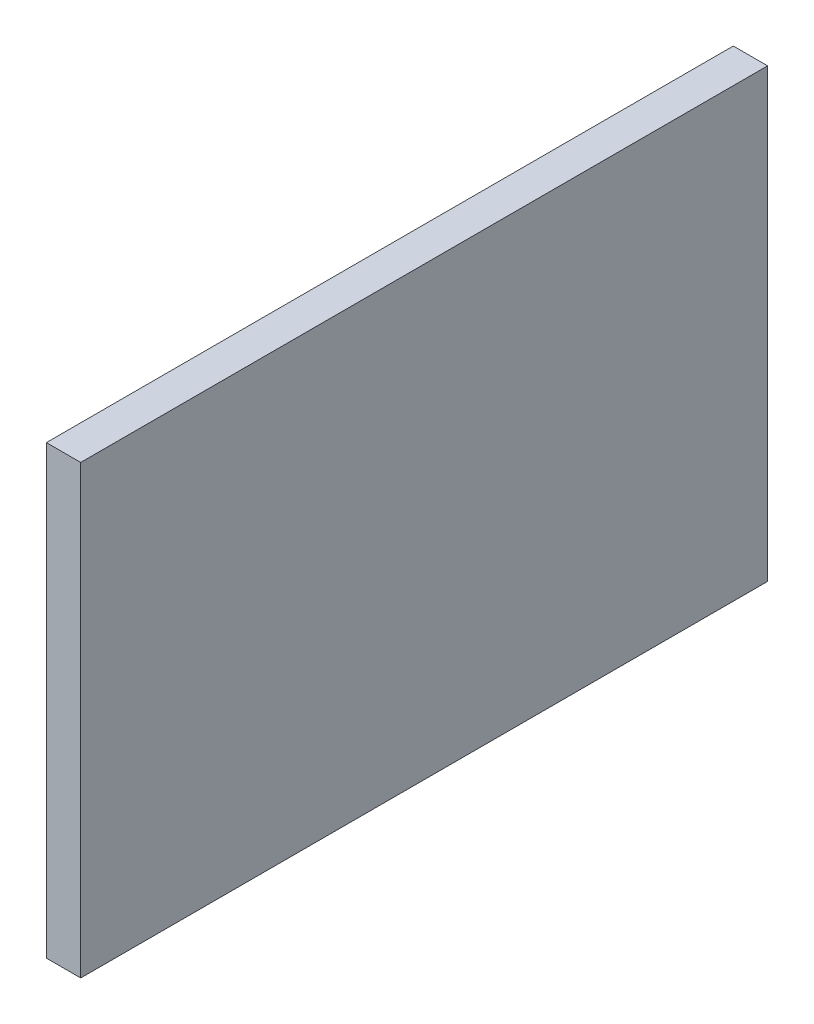
ISO-10303-21;
HEADER;
FILE_DESCRIPTION(('STEP AP214'),'2;1');
FILE_NAME('part.step','',(''),(''),'','','');
FILE_SCHEMA(('AUTOMOTIVE_DESIGN { 1 0 10303 214 1 1 1 1 }'));
ENDSEC;
DATA;
#1=APPLICATION_CONTEXT('core data for automotive mechanical design processes');
#2=APPLICATION_PROTOCOL_DEFINITION('international standard','automotive_design',2000,#1);
#3=PRODUCT_CONTEXT('',#1,'mechanical');
#4=PRODUCT('Part','Part','',(#3));
#5=PRODUCT_RELATED_PRODUCT_CATEGORY('part','',(#4));
#6=PRODUCT_DEFINITION_FORMATION('','',#4);
#7=PRODUCT_DEFINITION_CONTEXT('part definition',#1,'design');
#8=PRODUCT_DEFINITION('design','',#6,#7);
#9=PRODUCT_DEFINITION_SHAPE('','',#8);
#10=(LENGTH_UNIT() NAMED_UNIT(*) SI_UNIT(.MILLI.,.METRE.));
#11=(NAMED_UNIT(*) PLANE_ANGLE_UNIT() SI_UNIT($,.RADIAN.));
#12=(NAMED_UNIT(*) SI_UNIT($,.STERADIAN.) SOLID_ANGLE_UNIT());
#13=UNCERTAINTY_MEASURE_WITH_UNIT(LENGTH_MEASURE(1.E-05),#10,'distance_accuracy_value','');
#14=(GEOMETRIC_REPRESENTATION_CONTEXT(3) GLOBAL_UNCERTAINTY_ASSIGNED_CONTEXT((#13)) GLOBAL_UNIT_ASSIGNED_CONTEXT((#10,
#11,#12)) REPRESENTATION_CONTEXT('',''));
#15=CARTESIAN_POINT('',(0.,0.,0.));
#16=DIRECTION('',(0.,0.,1.));
#17=DIRECTION('',(1.,0.,0.));
#18=AXIS2_PLACEMENT_3D('',#15,#16,#17);
#19=CARTESIAN_POINT('',(25.4,26.8007352941176,466.818382352941));
#20=DIRECTION('',(0.,0.,-1.));
#21=DIRECTION('',(0.,1.,0.));
#22=AXIS2_PLACEMENT_3D('',#19,#20,#21);
#23=PLANE('',#22);
#24=DIRECTION('',(0.,-1.,0.));
#25=VECTOR('',#24,1.);
#26=CARTESIAN_POINT('',(0.,26.8007352941176,466.818382352941));
#27=LINE('',#26,#25);
#28=CARTESIAN_POINT('',(0.,26.8007352941176,466.818382352941));
#29=VERTEX_POINT('',#28);
#30=CARTESIAN_POINT('',(0.,-303.399264705882,466.818382352941));
#31=VERTEX_POINT('',#30);
#32=EDGE_CURVE('E99',#29,#31,#27,.T.);
#33=ORIENTED_EDGE('',*,*,#32,.T.);
#34=DIRECTION('',(-1.,0.,0.));
#35=VECTOR('',#34,1.);
#36=CARTESIAN_POINT('',(25.4,-303.399264705882,466.818382352941));
#37=LINE('',#36,#35);
#38=CARTESIAN_POINT('',(25.4,-303.399264705882,466.818382352941));
#39=VERTEX_POINT('',#38);
#40=EDGE_CURVE('E11',#39,#31,#37,.T.);
#41=ORIENTED_EDGE('',*,*,#40,.F.);
#42=DIRECTION('',(0.,-1.,0.));
#43=VECTOR('',#42,1.);
#44=CARTESIAN_POINT('',(25.4,26.8007352941176,466.818382352941));
#45=LINE('',#44,#43);
#46=CARTESIAN_POINT('',(25.4,26.8007352941176,466.818382352941));
#47=VERTEX_POINT('',#46);
#48=EDGE_CURVE('E87',#47,#39,#45,.T.);
#49=ORIENTED_EDGE('',*,*,#48,.F.);
#50=DIRECTION('',(-1.,0.,0.));
#51=VECTOR('',#50,1.);
#52=CARTESIAN_POINT('',(25.4,26.8007352941176,466.818382352941));
#53=LINE('',#52,#51);
#54=EDGE_CURVE('E95',#47,#29,#53,.T.);
#55=ORIENTED_EDGE('',*,*,#54,.T.);
#56=EDGE_LOOP('',(#33,#41,#49,#55));
#57=FACE_BOUND('',#56,.T.);
#58=ADVANCED_FACE('F36',(#57),#23,.F.);
#59=CARTESIAN_POINT('',(25.4,-303.399264705882,466.818382352941));
#60=DIRECTION('',(0.,1.,0.));
#61=DIRECTION('',(0.,0.,1.));
#62=AXIS2_PLACEMENT_3D('',#59,#60,#61);
#63=PLANE('',#62);
#64=DIRECTION('',(0.,0.,-1.));
#65=VECTOR('',#64,1.);
#66=CARTESIAN_POINT('',(0.,-303.399264705882,466.818382352941));
#67=LINE('',#66,#65);
#68=CARTESIAN_POINT('',(0.,-303.399264705882,-41.1816176470589));
#69=VERTEX_POINT('',#68);
#70=EDGE_CURVE('E91',#31,#69,#67,.T.);
#71=ORIENTED_EDGE('',*,*,#70,.T.);
#72=DIRECTION('',(-1.,0.,0.));
#73=VECTOR('',#72,1.);
#74=CARTESIAN_POINT('',(25.4,-303.399264705882,-41.1816176470589));
#75=LINE('',#74,#73);
#76=CARTESIAN_POINT('',(25.4,-303.399264705882,-41.1816176470589));
#77=VERTEX_POINT('',#76);
#78=EDGE_CURVE('E44',#77,#69,#75,.T.);
#79=ORIENTED_EDGE('',*,*,#78,.F.);
#80=DIRECTION('',(0.,0.,-1.));
#81=VECTOR('',#80,1.);
#82=CARTESIAN_POINT('',(25.4,-303.399264705882,466.818382352941));
#83=LINE('',#82,#81);
#84=EDGE_CURVE('E82',#39,#77,#83,.T.);
#85=ORIENTED_EDGE('',*,*,#84,.F.);
#86=ORIENTED_EDGE('',*,*,#40,.T.);
#87=EDGE_LOOP('',(#71,#79,#85,#86));
#88=FACE_BOUND('',#87,.T.);
#89=ADVANCED_FACE('F90',(#88),#63,.F.);
#90=CARTESIAN_POINT('',(25.4,26.8007352941176,-41.1816176470588));
#91=DIRECTION('',(0.,0.,1.));
#92=DIRECTION('',(0.,-1.,0.));
#93=AXIS2_PLACEMENT_3D('',#90,#91,#92);
#94=PLANE('',#93);
#95=DIRECTION('',(0.,1.,0.));
#96=VECTOR('',#95,1.);
#97=CARTESIAN_POINT('',(0.,26.8007352941176,-41.1816176470588));
#98=LINE('',#97,#96);
#99=CARTESIAN_POINT('',(0.,26.8007352941176,-41.1816176470588));
#100=VERTEX_POINT('',#99);
#101=EDGE_CURVE('E69',#69,#100,#98,.T.);
#102=ORIENTED_EDGE('',*,*,#101,.T.);
#103=DIRECTION('',(-1.,0.,0.));
#104=VECTOR('',#103,1.);
#105=CARTESIAN_POINT('',(25.4,26.8007352941176,-41.1816176470588));
#106=LINE('',#105,#104);
#107=CARTESIAN_POINT('',(25.4,26.8007352941176,-41.1816176470588));
#108=VERTEX_POINT('',#107);
#109=EDGE_CURVE('E92',#108,#100,#106,.T.);
#110=ORIENTED_EDGE('',*,*,#109,.F.);
#111=DIRECTION('',(0.,1.,0.));
#112=VECTOR('',#111,1.);
#113=CARTESIAN_POINT('',(25.4,26.8007352941176,-41.1816176470588));
#114=LINE('',#113,#112);
#115=EDGE_CURVE('E85',#77,#108,#114,.T.);
#116=ORIENTED_EDGE('',*,*,#115,.F.);
#117=ORIENTED_EDGE('',*,*,#78,.T.);
#118=EDGE_LOOP('',(#102,#110,#116,#117));
#119=FACE_BOUND('',#118,.T.);
#120=ADVANCED_FACE('F93',(#119),#94,.F.);
#121=CARTESIAN_POINT('',(25.4,26.8007352941176,466.818382352941));
#122=DIRECTION('',(0.,-1.,0.));
#123=DIRECTION('',(0.,0.,-1.));
#124=AXIS2_PLACEMENT_3D('',#121,#122,#123);
#125=PLANE('',#124);
#126=DIRECTION('',(0.,0.,1.));
#127=VECTOR('',#126,1.);
#128=CARTESIAN_POINT('',(0.,26.8007352941176,466.818382352941));
#129=LINE('',#128,#127);
#130=EDGE_CURVE('E75',#100,#29,#129,.T.);
#131=ORIENTED_EDGE('',*,*,#130,.T.);
#132=ORIENTED_EDGE('',*,*,#54,.F.);
#133=DIRECTION('',(0.,0.,1.));
#134=VECTOR('',#133,1.);
#135=CARTESIAN_POINT('',(25.4,26.8007352941176,466.818382352941));
#136=LINE('',#135,#134);
#137=EDGE_CURVE('E52',#108,#47,#136,.T.);
#138=ORIENTED_EDGE('',*,*,#137,.F.);
#139=ORIENTED_EDGE('',*,*,#109,.T.);
#140=EDGE_LOOP('',(#131,#132,#138,#139));
#141=FACE_BOUND('',#140,.T.);
#142=ADVANCED_FACE('F107',(#141),#125,.F.);
#143=CARTESIAN_POINT('',(25.4,0.,0.));
#144=DIRECTION('',(1.,0.,0.));
#145=DIRECTION('',(0.,0.,-1.));
#146=AXIS2_PLACEMENT_3D('',#143,#144,#145);
#147=PLANE('',#146);
#148=ORIENTED_EDGE('',*,*,#48,.T.);
#149=ORIENTED_EDGE('',*,*,#84,.T.);
#150=ORIENTED_EDGE('',*,*,#115,.T.);
#151=ORIENTED_EDGE('',*,*,#137,.T.);
#152=EDGE_LOOP('',(#148,#149,#150,#151));
#153=FACE_BOUND('',#152,.T.);
#154=ADVANCED_FACE('F83',(#153),#147,.T.);
#155=CARTESIAN_POINT('',(0.,0.,0.));
#156=DIRECTION('',(1.,0.,0.));
#157=DIRECTION('',(0.,0.,-1.));
#158=AXIS2_PLACEMENT_3D('',#155,#156,#157);
#159=PLANE('',#158);
#160=CARTESIAN_POINT('',(0.,-23.9992647058824,9.61838235294114));
#161=DIRECTION('',(-1.,0.,0.));
#162=DIRECTION('',(0.,0.,1.));
#163=AXIS2_PLACEMENT_3D('',#160,#161,#162);
#164=CIRCLE('',#163,12.7);
#165=CARTESIAN_POINT('',(0.,-23.9992647058824,22.3183823529411));
#166=VERTEX_POINT('',#165);
#167=EDGE_CURVE('E113',#166,#166,#164,.T.);
#168=ORIENTED_EDGE('',*,*,#167,.F.);
#169=EDGE_LOOP('',(#168));
#170=FACE_BOUND('',#169,.T.);
#171=ORIENTED_EDGE('',*,*,#32,.F.);
#172=ORIENTED_EDGE('',*,*,#130,.F.);
#173=ORIENTED_EDGE('',*,*,#101,.F.);
#174=ORIENTED_EDGE('',*,*,#70,.F.);
#175=EDGE_LOOP('',(#171,#172,#173,#174));
#176=FACE_BOUND('',#175,.T.);
#177=ADVANCED_FACE('F110',(#170,#176),#159,.F.);
#178=CARTESIAN_POINT('',(6.35,-23.9992647058824,9.61838235294114));
#179=DIRECTION('',(-1.,0.,0.));
#180=DIRECTION('',(0.,0.,1.));
#181=AXIS2_PLACEMENT_3D('',#178,#179,#180);
#182=CYLINDRICAL_SURFACE('',#181,12.7);
#183=CARTESIAN_POINT('',(6.35,-23.9992647058824,9.61838235294114));
#184=DIRECTION('',(-1.,0.,0.));
#185=DIRECTION('',(0.,0.,1.));
#186=AXIS2_PLACEMENT_3D('',#183,#184,#185);
#187=CIRCLE('',#186,12.7);
#188=CARTESIAN_POINT('',(6.35,-23.9992647058824,22.3183823529411));
#189=VERTEX_POINT('',#188);
#190=EDGE_CURVE('E102',#189,#189,#187,.T.);
#191=ORIENTED_EDGE('',*,*,#190,.F.);
#192=EDGE_LOOP('',(#191));
#193=FACE_BOUND('',#192,.T.);
#194=ORIENTED_EDGE('',*,*,#167,.T.);
#195=EDGE_LOOP('',(#194));
#196=FACE_BOUND('',#195,.T.);
#197=ADVANCED_FACE('F121',(#193,#196),#182,.F.);
#198=CARTESIAN_POINT('',(6.35,-23.9992647058824,9.61838235294114));
#199=DIRECTION('',(-1.,0.,0.));
#200=DIRECTION('',(0.,0.,1.));
#201=AXIS2_PLACEMENT_3D('',#198,#199,#200);
#202=PLANE('',#201);
#203=ORIENTED_EDGE('',*,*,#190,.T.);
#204=EDGE_LOOP('',(#203));
#205=FACE_BOUND('',#204,.T.);
#206=ADVANCED_FACE('F119',(#205),#202,.T.);
#207=CLOSED_SHELL('',(#58,#89,#120,#142,#154,#177,#197,#206));
#208=MANIFOLD_SOLID_BREP('B2',#207);
#209=ADVANCED_BREP_SHAPE_REPRESENTATION('',(#18,#208),#14);
#210=SHAPE_DEFINITION_REPRESENTATION(#9,#209);
ENDSEC;
END-ISO-10303-21;
